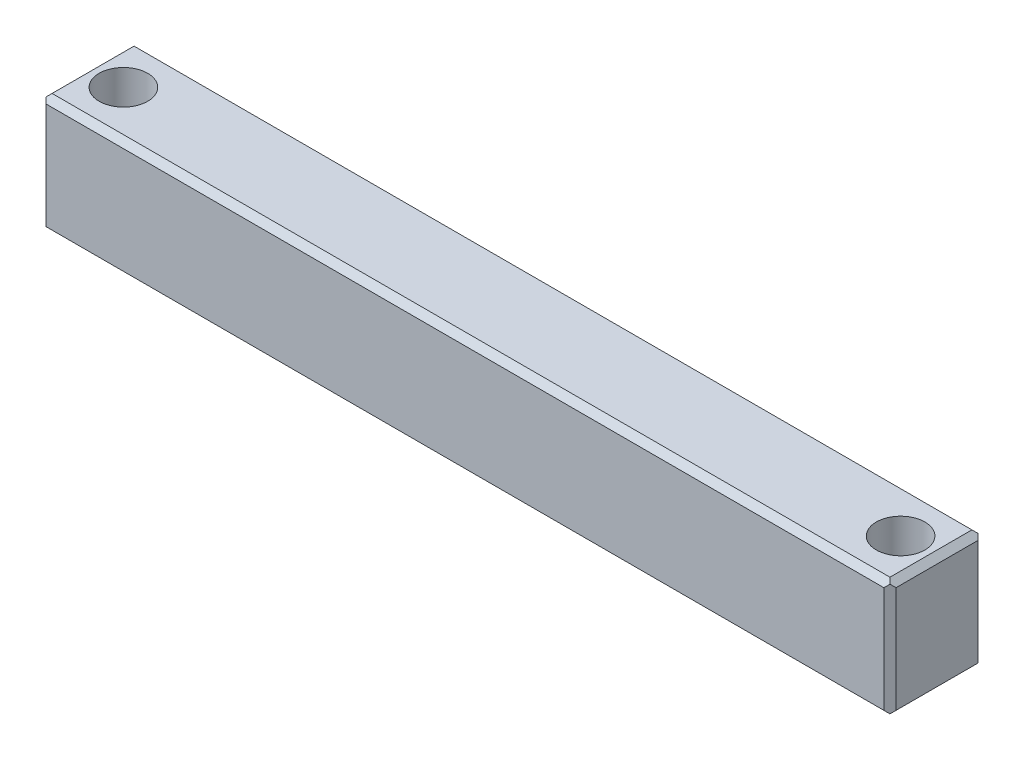
ISO-10303-21;
HEADER;
FILE_DESCRIPTION(('STEP AP214'),'2;1');
FILE_NAME('part.step','',(''),(''),'','','');
FILE_SCHEMA(('AUTOMOTIVE_DESIGN { 1 0 10303 214 1 1 1 1 }'));
ENDSEC;
DATA;
#1=APPLICATION_CONTEXT('core data for automotive mechanical design processes');
#2=APPLICATION_PROTOCOL_DEFINITION('international standard','automotive_design',2000,#1);
#3=PRODUCT_CONTEXT('',#1,'mechanical');
#4=PRODUCT('Part','Part','',(#3));
#5=PRODUCT_RELATED_PRODUCT_CATEGORY('part','',(#4));
#6=PRODUCT_DEFINITION_FORMATION('','',#4);
#7=PRODUCT_DEFINITION_CONTEXT('part definition',#1,'design');
#8=PRODUCT_DEFINITION('design','',#6,#7);
#9=PRODUCT_DEFINITION_SHAPE('','',#8);
#10=(LENGTH_UNIT() NAMED_UNIT(*) SI_UNIT(.MILLI.,.METRE.));
#11=(NAMED_UNIT(*) PLANE_ANGLE_UNIT() SI_UNIT($,.RADIAN.));
#12=(NAMED_UNIT(*) SI_UNIT($,.STERADIAN.) SOLID_ANGLE_UNIT());
#13=UNCERTAINTY_MEASURE_WITH_UNIT(LENGTH_MEASURE(1.E-05),#10,'distance_accuracy_value','');
#14=(GEOMETRIC_REPRESENTATION_CONTEXT(3) GLOBAL_UNCERTAINTY_ASSIGNED_CONTEXT((#13)) GLOBAL_UNIT_ASSIGNED_CONTEXT((#10,
#11,#12)) REPRESENTATION_CONTEXT('',''));
#15=CARTESIAN_POINT('',(0.,0.,0.));
#16=DIRECTION('',(0.,0.,1.));
#17=DIRECTION('',(1.,0.,0.));
#18=AXIS2_PLACEMENT_3D('',#15,#16,#17);
#19=CARTESIAN_POINT('',(70.,0.,0.));
#20=DIRECTION('',(0.,0.,-1.));
#21=DIRECTION('',(0.,1.,0.));
#22=AXIS2_PLACEMENT_3D('',#19,#20,#21);
#23=PLANE('',#22);
#24=DIRECTION('',(0.,1.,0.));
#25=VECTOR('',#24,1.);
#26=CARTESIAN_POINT('',(69.5,0.,0.));
#27=LINE('',#26,#25);
#28=CARTESIAN_POINT('',(69.5,0.499999999999987,0.));
#29=VERTEX_POINT('',#28);
#30=CARTESIAN_POINT('',(69.5,9.25000000000001,0.));
#31=VERTEX_POINT('',#30);
#32=EDGE_CURVE('E191',#29,#31,#27,.T.);
#33=ORIENTED_EDGE('',*,*,#32,.T.);
#34=DIRECTION('',(-1.,0.,0.));
#35=VECTOR('',#34,1.);
#36=CARTESIAN_POINT('',(70.,9.25000000000001,0.));
#37=LINE('',#36,#35);
#38=CARTESIAN_POINT('',(0.499999999999987,9.25000000000001,0.));
#39=VERTEX_POINT('',#38);
#40=EDGE_CURVE('E223',#31,#39,#37,.T.);
#41=ORIENTED_EDGE('',*,*,#40,.T.);
#42=DIRECTION('',(0.,-1.,0.));
#43=VECTOR('',#42,1.);
#44=CARTESIAN_POINT('',(0.499999999999987,0.,0.));
#45=LINE('',#44,#43);
#46=CARTESIAN_POINT('',(0.499999999999987,0.499999999999987,0.));
#47=VERTEX_POINT('',#46);
#48=EDGE_CURVE('E194',#39,#47,#45,.T.);
#49=ORIENTED_EDGE('',*,*,#48,.T.);
#50=DIRECTION('',(1.,0.,0.));
#51=VECTOR('',#50,1.);
#52=CARTESIAN_POINT('',(70.,0.499999999999987,0.));
#53=LINE('',#52,#51);
#54=EDGE_CURVE('E207',#47,#29,#53,.T.);
#55=ORIENTED_EDGE('',*,*,#54,.T.);
#56=EDGE_LOOP('',(#33,#41,#49,#55));
#57=FACE_BOUND('',#56,.T.);
#58=ADVANCED_FACE('F35',(#57),#23,.F.);
#59=CARTESIAN_POINT('',(70.,0.,0.));
#60=DIRECTION('',(0.,1.,0.));
#61=DIRECTION('',(0.,0.,1.));
#62=AXIS2_PLACEMENT_3D('',#59,#60,#61);
#63=PLANE('',#62);
#64=CARTESIAN_POINT('',(3.,0.,-3.875));
#65=DIRECTION('',(0.,1.,0.));
#66=DIRECTION('',(0.,0.,1.));
#67=AXIS2_PLACEMENT_3D('',#64,#65,#66);
#68=CIRCLE('',#67,2.);
#69=CARTESIAN_POINT('',(3.,0.,-1.87499999999999));
#70=VERTEX_POINT('',#69);
#71=EDGE_CURVE('E304',#70,#70,#68,.F.);
#72=ORIENTED_EDGE('',*,*,#71,.F.);
#73=EDGE_LOOP('',(#72));
#74=FACE_BOUND('',#73,.T.);
#75=CARTESIAN_POINT('',(67.,0.,-3.87499999999999));
#76=DIRECTION('',(0.,1.,0.));
#77=DIRECTION('',(0.,0.,1.));
#78=AXIS2_PLACEMENT_3D('',#75,#76,#77);
#79=CIRCLE('',#78,2.);
#80=CARTESIAN_POINT('',(67.,0.,-1.875));
#81=VERTEX_POINT('',#80);
#82=EDGE_CURVE('E312',#81,#81,#79,.F.);
#83=ORIENTED_EDGE('',*,*,#82,.F.);
#84=EDGE_LOOP('',(#83));
#85=FACE_BOUND('',#84,.T.);
#86=DIRECTION('',(0.,0.,1.));
#87=VECTOR('',#86,1.);
#88=CARTESIAN_POINT('',(69.5,0.,0.));
#89=LINE('',#88,#87);
#90=CARTESIAN_POINT('',(69.5,0.,-7.25000000000001));
#91=VERTEX_POINT('',#90);
#92=CARTESIAN_POINT('',(69.5,0.,-0.499999999999986));
#93=VERTEX_POINT('',#92);
#94=EDGE_CURVE('E300',#91,#93,#89,.T.);
#95=ORIENTED_EDGE('',*,*,#94,.T.);
#96=DIRECTION('',(-1.,0.,0.));
#97=VECTOR('',#96,1.);
#98=CARTESIAN_POINT('',(70.,0.,-0.499999999999986));
#99=LINE('',#98,#97);
#100=CARTESIAN_POINT('',(0.499999999999987,0.,-0.499999999999987));
#101=VERTEX_POINT('',#100);
#102=EDGE_CURVE('E249',#93,#101,#99,.T.);
#103=ORIENTED_EDGE('',*,*,#102,.T.);
#104=DIRECTION('',(0.,0.,-1.));
#105=VECTOR('',#104,1.);
#106=CARTESIAN_POINT('',(0.499999999999987,0.,-7.75000000000001));
#107=LINE('',#106,#105);
#108=CARTESIAN_POINT('',(0.499999999999987,0.,-7.25000000000001));
#109=VERTEX_POINT('',#108);
#110=EDGE_CURVE('E172',#101,#109,#107,.T.);
#111=ORIENTED_EDGE('',*,*,#110,.T.);
#112=DIRECTION('',(1.,0.,0.));
#113=VECTOR('',#112,1.);
#114=CARTESIAN_POINT('',(70.,0.,-7.25000000000001));
#115=LINE('',#114,#113);
#116=EDGE_CURVE('E247',#109,#91,#115,.T.);
#117=ORIENTED_EDGE('',*,*,#116,.T.);
#118=EDGE_LOOP('',(#95,#103,#111,#117));
#119=FACE_BOUND('',#118,.T.);
#120=ADVANCED_FACE('F317',(#74,#85,#119),#63,.F.);
#121=CARTESIAN_POINT('',(70.,0.,-7.75000000000001));
#122=DIRECTION('',(0.,0.,1.));
#123=DIRECTION('',(0.,-1.,0.));
#124=AXIS2_PLACEMENT_3D('',#121,#122,#123);
#125=PLANE('',#124);
#126=DIRECTION('',(0.,1.,0.));
#127=VECTOR('',#126,1.);
#128=CARTESIAN_POINT('',(0.499999999999987,9.75,-7.75));
#129=LINE('',#128,#127);
#130=CARTESIAN_POINT('',(0.499999999999987,0.499999999999987,-7.75000000000001));
#131=VERTEX_POINT('',#130);
#132=CARTESIAN_POINT('',(0.499999999999987,9.25,-7.75));
#133=VERTEX_POINT('',#132);
#134=EDGE_CURVE('E179',#131,#133,#129,.T.);
#135=ORIENTED_EDGE('',*,*,#134,.T.);
#136=DIRECTION('',(1.,0.,0.));
#137=VECTOR('',#136,1.);
#138=CARTESIAN_POINT('',(70.,9.25,-7.75));
#139=LINE('',#138,#137);
#140=CARTESIAN_POINT('',(69.5,9.25,-7.75));
#141=VERTEX_POINT('',#140);
#142=EDGE_CURVE('E57',#133,#141,#139,.T.);
#143=ORIENTED_EDGE('',*,*,#142,.T.);
#144=DIRECTION('',(0.,-1.,0.));
#145=VECTOR('',#144,1.);
#146=CARTESIAN_POINT('',(69.5,0.,-7.75000000000001));
#147=LINE('',#146,#145);
#148=CARTESIAN_POINT('',(69.5,0.499999999999986,-7.75000000000001));
#149=VERTEX_POINT('',#148);
#150=EDGE_CURVE('E177',#141,#149,#147,.T.);
#151=ORIENTED_EDGE('',*,*,#150,.T.);
#152=DIRECTION('',(-1.,0.,0.));
#153=VECTOR('',#152,1.);
#154=CARTESIAN_POINT('',(70.,0.499999999999986,-7.75000000000001));
#155=LINE('',#154,#153);
#156=EDGE_CURVE('E263',#149,#131,#155,.T.);
#157=ORIENTED_EDGE('',*,*,#156,.T.);
#158=EDGE_LOOP('',(#135,#143,#151,#157));
#159=FACE_BOUND('',#158,.T.);
#160=ADVANCED_FACE('F268',(#159),#125,.F.);
#161=CARTESIAN_POINT('',(70.,9.75,0.));
#162=DIRECTION('',(0.,-1.,0.));
#163=DIRECTION('',(0.,0.,-1.));
#164=AXIS2_PLACEMENT_3D('',#161,#162,#163);
#165=PLANE('',#164);
#166=CARTESIAN_POINT('',(3.,9.75,-3.875));
#167=DIRECTION('',(0.,1.,0.));
#168=DIRECTION('',(0.,0.,1.));
#169=AXIS2_PLACEMENT_3D('',#166,#167,#168);
#170=CIRCLE('',#169,2.);
#171=CARTESIAN_POINT('',(3.,9.75,-1.87499999999999));
#172=VERTEX_POINT('',#171);
#173=EDGE_CURVE('E309',#172,#172,#170,.T.);
#174=ORIENTED_EDGE('',*,*,#173,.F.);
#175=EDGE_LOOP('',(#174));
#176=FACE_BOUND('',#175,.T.);
#177=CARTESIAN_POINT('',(67.,9.75,-3.87499999999999));
#178=DIRECTION('',(0.,1.,0.));
#179=DIRECTION('',(0.,0.,1.));
#180=AXIS2_PLACEMENT_3D('',#177,#178,#179);
#181=CIRCLE('',#180,2.);
#182=CARTESIAN_POINT('',(67.,9.75,-1.875));
#183=VERTEX_POINT('',#182);
#184=EDGE_CURVE('E213',#183,#183,#181,.T.);
#185=ORIENTED_EDGE('',*,*,#184,.F.);
#186=EDGE_LOOP('',(#185));
#187=FACE_BOUND('',#186,.T.);
#188=DIRECTION('',(0.,0.,1.));
#189=VECTOR('',#188,1.);
#190=CARTESIAN_POINT('',(0.499999999999987,9.75,0.));
#191=LINE('',#190,#189);
#192=CARTESIAN_POINT('',(0.499999999999987,9.75,-7.25));
#193=VERTEX_POINT('',#192);
#194=CARTESIAN_POINT('',(0.499999999999987,9.75,-0.499999999999987));
#195=VERTEX_POINT('',#194);
#196=EDGE_CURVE('E188',#193,#195,#191,.T.);
#197=ORIENTED_EDGE('',*,*,#196,.T.);
#198=DIRECTION('',(1.,0.,0.));
#199=VECTOR('',#198,1.);
#200=CARTESIAN_POINT('',(70.,9.75,-0.499999999999987));
#201=LINE('',#200,#199);
#202=CARTESIAN_POINT('',(69.5,9.75,-0.499999999999987));
#203=VERTEX_POINT('',#202);
#204=EDGE_CURVE('E237',#195,#203,#201,.T.);
#205=ORIENTED_EDGE('',*,*,#204,.T.);
#206=DIRECTION('',(0.,0.,-1.));
#207=VECTOR('',#206,1.);
#208=CARTESIAN_POINT('',(69.5,9.75,0.));
#209=LINE('',#208,#207);
#210=CARTESIAN_POINT('',(69.5,9.75,-7.25));
#211=VERTEX_POINT('',#210);
#212=EDGE_CURVE('E185',#203,#211,#209,.T.);
#213=ORIENTED_EDGE('',*,*,#212,.T.);
#214=DIRECTION('',(-1.,0.,0.));
#215=VECTOR('',#214,1.);
#216=CARTESIAN_POINT('',(70.,9.75,-7.25));
#217=LINE('',#216,#215);
#218=EDGE_CURVE('E234',#211,#193,#217,.T.);
#219=ORIENTED_EDGE('',*,*,#218,.T.);
#220=EDGE_LOOP('',(#197,#205,#213,#219));
#221=FACE_BOUND('',#220,.T.);
#222=ADVANCED_FACE('F332',(#176,#187,#221),#165,.F.);
#223=CARTESIAN_POINT('',(70.,0.,0.));
#224=DIRECTION('',(-1.,0.,0.));
#225=DIRECTION('',(0.,0.,1.));
#226=AXIS2_PLACEMENT_3D('',#223,#224,#225);
#227=PLANE('',#226);
#228=DIRECTION('',(0.,1.,0.));
#229=VECTOR('',#228,1.);
#230=CARTESIAN_POINT('',(70.,0.,-7.25));
#231=LINE('',#230,#229);
#232=CARTESIAN_POINT('',(70.,0.5,-7.25));
#233=VERTEX_POINT('',#232);
#234=CARTESIAN_POINT('',(70.,9.25,-7.25));
#235=VERTEX_POINT('',#234);
#236=EDGE_CURVE('E202',#233,#235,#231,.T.);
#237=ORIENTED_EDGE('',*,*,#236,.T.);
#238=DIRECTION('',(0.,0.,1.));
#239=VECTOR('',#238,1.);
#240=CARTESIAN_POINT('',(70.,9.25,0.));
#241=LINE('',#240,#239);
#242=CARTESIAN_POINT('',(70.,9.25,-0.499999999999994));
#243=VERTEX_POINT('',#242);
#244=EDGE_CURVE('E204',#235,#243,#241,.T.);
#245=ORIENTED_EDGE('',*,*,#244,.T.);
#246=DIRECTION('',(0.,-1.,0.));
#247=VECTOR('',#246,1.);
#248=CARTESIAN_POINT('',(70.,0.,-0.5));
#249=LINE('',#248,#247);
#250=CARTESIAN_POINT('',(70.,0.5,-0.5));
#251=VERTEX_POINT('',#250);
#252=EDGE_CURVE('E197',#243,#251,#249,.T.);
#253=ORIENTED_EDGE('',*,*,#252,.T.);
#254=DIRECTION('',(0.,0.,-1.));
#255=VECTOR('',#254,1.);
#256=CARTESIAN_POINT('',(70.,0.5,0.));
#257=LINE('',#256,#255);
#258=EDGE_CURVE('E200',#251,#233,#257,.T.);
#259=ORIENTED_EDGE('',*,*,#258,.T.);
#260=EDGE_LOOP('',(#237,#245,#253,#259));
#261=FACE_BOUND('',#260,.T.);
#262=ADVANCED_FACE('F289',(#261),#227,.F.);
#263=CARTESIAN_POINT('',(0.,0.,0.));
#264=DIRECTION('',(-1.,0.,0.));
#265=DIRECTION('',(0.,0.,1.));
#266=AXIS2_PLACEMENT_3D('',#263,#264,#265);
#267=PLANE('',#266);
#268=DIRECTION('',(0.,-1.,0.));
#269=VECTOR('',#268,1.);
#270=CARTESIAN_POINT('',(0.,0.,-7.25000000000001));
#271=LINE('',#270,#269);
#272=CARTESIAN_POINT('',(0.,9.25000000000001,-7.25));
#273=VERTEX_POINT('',#272);
#274=CARTESIAN_POINT('',(0.,0.499999999999994,-7.25000000000001));
#275=VERTEX_POINT('',#274);
#276=EDGE_CURVE('E176',#273,#275,#271,.T.);
#277=ORIENTED_EDGE('',*,*,#276,.T.);
#278=DIRECTION('',(0.,0.,1.));
#279=VECTOR('',#278,1.);
#280=CARTESIAN_POINT('',(0.,0.499999999999994,0.));
#281=LINE('',#280,#279);
#282=CARTESIAN_POINT('',(0.,0.499999999999994,-0.499999999999993));
#283=VERTEX_POINT('',#282);
#284=EDGE_CURVE('E155',#275,#283,#281,.T.);
#285=ORIENTED_EDGE('',*,*,#284,.T.);
#286=DIRECTION('',(0.,1.,0.));
#287=VECTOR('',#286,1.);
#288=CARTESIAN_POINT('',(0.,9.75,-0.499999999999986));
#289=LINE('',#288,#287);
#290=CARTESIAN_POINT('',(0.,9.25000000000001,-0.499999999999987));
#291=VERTEX_POINT('',#290);
#292=EDGE_CURVE('E164',#283,#291,#289,.T.);
#293=ORIENTED_EDGE('',*,*,#292,.T.);
#294=DIRECTION('',(0.,0.,-1.));
#295=VECTOR('',#294,1.);
#296=CARTESIAN_POINT('',(0.,9.25000000000001,-7.75));
#297=LINE('',#296,#295);
#298=EDGE_CURVE('E171',#291,#273,#297,.T.);
#299=ORIENTED_EDGE('',*,*,#298,.T.);
#300=EDGE_LOOP('',(#277,#285,#293,#299));
#301=FACE_BOUND('',#300,.T.);
#302=ADVANCED_FACE('F174',(#301),#267,.T.);
#303=CARTESIAN_POINT('',(67.,-5.65685424949238,-3.87499999999999));
#304=DIRECTION('',(0.,1.,0.));
#305=DIRECTION('',(0.,0.,1.));
#306=AXIS2_PLACEMENT_3D('',#303,#304,#305);
#307=CYLINDRICAL_SURFACE('',#306,2.);
#308=ORIENTED_EDGE('',*,*,#82,.T.);
#309=EDGE_LOOP('',(#308));
#310=FACE_BOUND('',#309,.T.);
#311=ORIENTED_EDGE('',*,*,#184,.T.);
#312=EDGE_LOOP('',(#311));
#313=FACE_BOUND('',#312,.T.);
#314=ADVANCED_FACE('F488',(#310,#313),#307,.F.);
#315=CARTESIAN_POINT('',(3.,-5.65685424949238,-3.875));
#316=DIRECTION('',(0.,1.,0.));
#317=DIRECTION('',(0.,0.,1.));
#318=AXIS2_PLACEMENT_3D('',#315,#316,#317);
#319=CYLINDRICAL_SURFACE('',#318,2.);
#320=ORIENTED_EDGE('',*,*,#71,.T.);
#321=EDGE_LOOP('',(#320));
#322=FACE_BOUND('',#321,.T.);
#323=ORIENTED_EDGE('',*,*,#173,.T.);
#324=EDGE_LOOP('',(#323));
#325=FACE_BOUND('',#324,.T.);
#326=ADVANCED_FACE('F373',(#322,#325),#319,.F.);
#327=CARTESIAN_POINT('',(0.499999999999987,9.75,0.));
#328=DIRECTION('',(-0.707106781186552,0.707106781186543,0.));
#329=DIRECTION('',(0.,0.,-1.));
#330=AXIS2_PLACEMENT_3D('',#327,#328,#329);
#331=PLANE('',#330);
#332=DIRECTION('',(-0.57735026918962,-0.577350269189628,-0.577350269189629));
#333=VECTOR('',#332,1.);
#334=CARTESIAN_POINT('',(-2.75,6.49999999999997,-3.25000000000003));
#335=LINE('',#334,#333);
#336=CARTESIAN_POINT('',(0.249999999999994,9.50000000000001,-0.249999999999989));
#337=VERTEX_POINT('',#336);
#338=EDGE_CURVE('E168',#337,#291,#335,.T.);
#339=ORIENTED_EDGE('',*,*,#338,.F.);
#340=DIRECTION('',(-0.577350269189618,-0.577350269189626,0.577350269189634));
#341=VECTOR('',#340,1.);
#342=CARTESIAN_POINT('',(0.333333333333322,9.58333333333333,-0.333333333333318));
#343=LINE('',#342,#341);
#344=EDGE_CURVE('E232',#337,#195,#343,.F.);
#345=ORIENTED_EDGE('',*,*,#344,.T.);
#346=ORIENTED_EDGE('',*,*,#196,.F.);
#347=DIRECTION('',(0.577350269189621,0.577350269189629,0.577350269189629));
#348=VECTOR('',#347,1.);
#349=CARTESIAN_POINT('',(2.91666666666664,12.1666666666667,-4.83333333333331));
#350=LINE('',#349,#348);
#351=CARTESIAN_POINT('',(0.24999999999999,9.5,-7.5));
#352=VERTEX_POINT('',#351);
#353=EDGE_CURVE('E230',#193,#352,#350,.F.);
#354=ORIENTED_EDGE('',*,*,#353,.T.);
#355=DIRECTION('',(-0.577350269189621,-0.577350269189629,0.577350269189628));
#356=VECTOR('',#355,1.);
#357=CARTESIAN_POINT('',(-2.08333333333334,7.16666666666664,-5.16666666666664));
#358=LINE('',#357,#356);
#359=EDGE_CURVE('E160',#273,#352,#358,.F.);
#360=ORIENTED_EDGE('',*,*,#359,.F.);
#361=ORIENTED_EDGE('',*,*,#298,.F.);
#362=EDGE_LOOP('',(#339,#345,#346,#354,#360,#361));
#363=FACE_BOUND('',#362,.T.);
#364=ADVANCED_FACE('F315',(#363),#331,.T.);
#365=CARTESIAN_POINT('',(0.499999999999987,0.,0.));
#366=DIRECTION('',(-0.707106781186552,0.,0.707106781186543));
#367=DIRECTION('',(0.,1.,0.));
#368=AXIS2_PLACEMENT_3D('',#365,#366,#367);
#369=PLANE('',#368);
#370=ORIENTED_EDGE('',*,*,#48,.F.);
#371=DIRECTION('',(0.577350269189623,-0.577350269189623,0.577350269189631));
#372=VECTOR('',#371,1.);
#373=CARTESIAN_POINT('',(3.58333333333329,6.16666666666671,3.08333333333335));
#374=LINE('',#373,#372);
#375=EDGE_CURVE('E228',#39,#337,#374,.F.);
#376=ORIENTED_EDGE('',*,*,#375,.T.);
#377=ORIENTED_EDGE('',*,*,#338,.T.);
#378=ORIENTED_EDGE('',*,*,#292,.F.);
#379=DIRECTION('',(0.577350269189621,-0.577350269189629,0.577350269189628));
#380=VECTOR('',#379,1.);
#381=CARTESIAN_POINT('',(0.499999999999987,0.,0.));
#382=LINE('',#381,#380);
#383=CARTESIAN_POINT('',(0.249999999999997,0.249999999999993,-0.249999999999993));
#384=VERTEX_POINT('',#383);
#385=EDGE_CURVE('E149',#384,#283,#382,.F.);
#386=ORIENTED_EDGE('',*,*,#385,.F.);
#387=DIRECTION('',(-0.57735026918962,-0.577350269189629,-0.577350269189629));
#388=VECTOR('',#387,1.);
#389=CARTESIAN_POINT('',(0.333333333333325,0.333333333333323,-0.166666666666664));
#390=LINE('',#389,#388);
#391=EDGE_CURVE('E226',#384,#47,#390,.F.);
#392=ORIENTED_EDGE('',*,*,#391,.T.);
#393=EDGE_LOOP('',(#370,#376,#377,#378,#386,#392));
#394=FACE_BOUND('',#393,.T.);
#395=ADVANCED_FACE('F166',(#394),#369,.T.);
#396=CARTESIAN_POINT('',(0.499999999999987,0.,-7.75000000000001));
#397=DIRECTION('',(-0.707106781186552,0.,-0.707106781186543));
#398=DIRECTION('',(0.,-1.,0.));
#399=AXIS2_PLACEMENT_3D('',#396,#397,#398);
#400=PLANE('',#399);
#401=ORIENTED_EDGE('',*,*,#359,.T.);
#402=DIRECTION('',(-0.57735026918962,0.577350269189629,0.577350269189629));
#403=VECTOR('',#402,1.);
#404=CARTESIAN_POINT('',(3.58333333333331,6.16666666666663,-10.8333333333334));
#405=LINE('',#404,#403);
#406=EDGE_CURVE('E261',#352,#133,#405,.F.);
#407=ORIENTED_EDGE('',*,*,#406,.T.);
#408=ORIENTED_EDGE('',*,*,#134,.F.);
#409=DIRECTION('',(0.577350269189623,0.577350269189623,-0.577350269189631));
#410=VECTOR('',#409,1.);
#411=CARTESIAN_POINT('',(0.333333333333326,0.333333333333326,-7.58333333333334));
#412=LINE('',#411,#410);
#413=CARTESIAN_POINT('',(0.249999999999995,0.249999999999995,-7.50000000000001));
#414=VERTEX_POINT('',#413);
#415=EDGE_CURVE('E259',#131,#414,#412,.F.);
#416=ORIENTED_EDGE('',*,*,#415,.T.);
#417=DIRECTION('',(-0.57735026918962,0.577350269189628,0.577350269189629));
#418=VECTOR('',#417,1.);
#419=CARTESIAN_POINT('',(0.499999999999987,0.,-7.75000000000001));
#420=LINE('',#419,#418);
#421=EDGE_CURVE('E161',#275,#414,#420,.F.);
#422=ORIENTED_EDGE('',*,*,#421,.F.);
#423=ORIENTED_EDGE('',*,*,#276,.F.);
#424=EDGE_LOOP('',(#401,#407,#408,#416,#422,#423));
#425=FACE_BOUND('',#424,.T.);
#426=ADVANCED_FACE('F271',(#425),#400,.T.);
#427=CARTESIAN_POINT('',(0.499999999999987,0.,0.));
#428=DIRECTION('',(-0.707106781186552,-0.707106781186543,0.));
#429=DIRECTION('',(0.,0.,1.));
#430=AXIS2_PLACEMENT_3D('',#427,#428,#429);
#431=PLANE('',#430);
#432=ORIENTED_EDGE('',*,*,#110,.F.);
#433=DIRECTION('',(0.57735026918962,-0.577350269189628,-0.577350269189628));
#434=VECTOR('',#433,1.);
#435=CARTESIAN_POINT('',(0.333333333333325,0.166666666666664,-0.333333333333323));
#436=LINE('',#435,#434);
#437=EDGE_CURVE('E157',#101,#384,#436,.F.);
#438=ORIENTED_EDGE('',*,*,#437,.T.);
#439=ORIENTED_EDGE('',*,*,#385,.T.);
#440=ORIENTED_EDGE('',*,*,#284,.F.);
#441=ORIENTED_EDGE('',*,*,#421,.T.);
#442=DIRECTION('',(-0.577350269189618,0.577350269189626,-0.577350269189634));
#443=VECTOR('',#442,1.);
#444=CARTESIAN_POINT('',(2.91666666666666,-2.4166666666667,-4.83333333333327));
#445=LINE('',#444,#443);
#446=EDGE_CURVE('E252',#414,#109,#445,.F.);
#447=ORIENTED_EDGE('',*,*,#446,.T.);
#448=EDGE_LOOP('',(#432,#438,#439,#440,#441,#447));
#449=FACE_BOUND('',#448,.T.);
#450=ADVANCED_FACE('F152',(#449),#431,.T.);
#451=CARTESIAN_POINT('',(70.,0.5,0.));
#452=DIRECTION('',(-0.707106781186547,0.707106781186547,0.));
#453=DIRECTION('',(0.,0.,-1.));
#454=AXIS2_PLACEMENT_3D('',#451,#452,#453);
#455=PLANE('',#454);
#456=DIRECTION('',(0.577350269189626,0.577350269189626,-0.577350269189626));
#457=VECTOR('',#456,1.);
#458=CARTESIAN_POINT('',(69.8333333333333,0.333333333333334,-0.333333333333334));
#459=LINE('',#458,#457);
#460=CARTESIAN_POINT('',(69.75,0.249999999999994,-0.249999999999994));
#461=VERTEX_POINT('',#460);
#462=EDGE_CURVE('E219',#461,#251,#459,.T.);
#463=ORIENTED_EDGE('',*,*,#462,.F.);
#464=DIRECTION('',(-0.577350269189626,-0.577350269189626,-0.577350269189626));
#465=VECTOR('',#464,1.);
#466=CARTESIAN_POINT('',(70.,0.5,0.));
#467=LINE('',#466,#465);
#468=EDGE_CURVE('E257',#461,#93,#467,.T.);
#469=ORIENTED_EDGE('',*,*,#468,.T.);
#470=ORIENTED_EDGE('',*,*,#94,.F.);
#471=DIRECTION('',(0.577350269189623,0.577350269189623,-0.577350269189631));
#472=VECTOR('',#471,1.);
#473=CARTESIAN_POINT('',(67.4166666666667,-2.08333333333335,-5.16666666666663));
#474=LINE('',#473,#472);
#475=CARTESIAN_POINT('',(69.75,0.249999999999993,-7.50000000000001));
#476=VERTEX_POINT('',#475);
#477=EDGE_CURVE('E255',#91,#476,#474,.T.);
#478=ORIENTED_EDGE('',*,*,#477,.T.);
#479=DIRECTION('',(0.577350269189626,0.577350269189626,0.577350269189626));
#480=VECTOR('',#479,1.);
#481=CARTESIAN_POINT('',(72.4166666666667,2.91666666666667,-4.83333333333333));
#482=LINE('',#481,#480);
#483=EDGE_CURVE('E208',#233,#476,#482,.F.);
#484=ORIENTED_EDGE('',*,*,#483,.F.);
#485=ORIENTED_EDGE('',*,*,#258,.F.);
#486=EDGE_LOOP('',(#463,#469,#470,#478,#484,#485));
#487=FACE_BOUND('',#486,.T.);
#488=ADVANCED_FACE('F298',(#487),#455,.F.);
#489=CARTESIAN_POINT('',(70.,0.,-7.25));
#490=DIRECTION('',(-0.707106781186547,0.,0.707106781186547));
#491=DIRECTION('',(0.,1.,0.));
#492=AXIS2_PLACEMENT_3D('',#489,#490,#491);
#493=PLANE('',#492);
#494=ORIENTED_EDGE('',*,*,#150,.F.);
#495=DIRECTION('',(0.577350269189626,0.577350269189626,0.577350269189626));
#496=VECTOR('',#495,1.);
#497=CARTESIAN_POINT('',(66.75,6.5,-10.5));
#498=LINE('',#497,#496);
#499=CARTESIAN_POINT('',(69.75,9.5,-7.5));
#500=VERTEX_POINT('',#499);
#501=EDGE_CURVE('E11',#141,#500,#498,.T.);
#502=ORIENTED_EDGE('',*,*,#501,.T.);
#503=DIRECTION('',(0.577350269189626,-0.577350269189626,0.577350269189626));
#504=VECTOR('',#503,1.);
#505=CARTESIAN_POINT('',(73.0833333333333,6.16666666666667,-4.16666666666667));
#506=LINE('',#505,#504);
#507=EDGE_CURVE('E216',#235,#500,#506,.F.);
#508=ORIENTED_EDGE('',*,*,#507,.F.);
#509=ORIENTED_EDGE('',*,*,#236,.F.);
#510=ORIENTED_EDGE('',*,*,#483,.T.);
#511=DIRECTION('',(-0.577350269189629,0.57735026918962,-0.577350269189628));
#512=VECTOR('',#511,1.);
#513=CARTESIAN_POINT('',(70.,0.,-7.25));
#514=LINE('',#513,#512);
#515=EDGE_CURVE('E44',#476,#149,#514,.T.);
#516=ORIENTED_EDGE('',*,*,#515,.T.);
#517=EDGE_LOOP('',(#494,#502,#508,#509,#510,#516));
#518=FACE_BOUND('',#517,.T.);
#519=ADVANCED_FACE('F280',(#518),#493,.F.);
#520=CARTESIAN_POINT('',(70.,0.,-0.5));
#521=DIRECTION('',(-0.707106781186547,0.,-0.707106781186547));
#522=DIRECTION('',(0.,-1.,0.));
#523=AXIS2_PLACEMENT_3D('',#520,#521,#522);
#524=PLANE('',#523);
#525=DIRECTION('',(-0.577350269189626,0.577350269189626,0.577350269189626));
#526=VECTOR('',#525,1.);
#527=CARTESIAN_POINT('',(73.0833333333333,6.16666666666667,-3.58333333333333));
#528=LINE('',#527,#526);
#529=CARTESIAN_POINT('',(69.75,9.50000000000001,-0.249999999999987));
#530=VERTEX_POINT('',#529);
#531=EDGE_CURVE('E214',#530,#243,#528,.F.);
#532=ORIENTED_EDGE('',*,*,#531,.F.);
#533=DIRECTION('',(-0.577350269189629,-0.57735026918962,0.577350269189628));
#534=VECTOR('',#533,1.);
#535=CARTESIAN_POINT('',(66.75,6.50000000000007,2.74999999999999));
#536=LINE('',#535,#534);
#537=EDGE_CURVE('E245',#530,#31,#536,.T.);
#538=ORIENTED_EDGE('',*,*,#537,.T.);
#539=ORIENTED_EDGE('',*,*,#32,.F.);
#540=DIRECTION('',(0.577350269189626,-0.577350269189626,-0.577350269189626));
#541=VECTOR('',#540,1.);
#542=CARTESIAN_POINT('',(70.,0.,-0.5));
#543=LINE('',#542,#541);
#544=EDGE_CURVE('E243',#29,#461,#543,.T.);
#545=ORIENTED_EDGE('',*,*,#544,.T.);
#546=ORIENTED_EDGE('',*,*,#462,.T.);
#547=ORIENTED_EDGE('',*,*,#252,.F.);
#548=EDGE_LOOP('',(#532,#538,#539,#545,#546,#547));
#549=FACE_BOUND('',#548,.T.);
#550=ADVANCED_FACE('F334',(#549),#524,.F.);
#551=CARTESIAN_POINT('',(70.,9.25,0.));
#552=DIRECTION('',(-0.707106781186547,-0.707106781186547,0.));
#553=DIRECTION('',(0.,0.,1.));
#554=AXIS2_PLACEMENT_3D('',#551,#552,#553);
#555=PLANE('',#554);
#556=ORIENTED_EDGE('',*,*,#212,.F.);
#557=DIRECTION('',(0.577350269189623,-0.577350269189623,0.577350269189631));
#558=VECTOR('',#557,1.);
#559=CARTESIAN_POINT('',(70.,9.25,0.));
#560=LINE('',#559,#558);
#561=EDGE_CURVE('E241',#203,#530,#560,.T.);
#562=ORIENTED_EDGE('',*,*,#561,.T.);
#563=ORIENTED_EDGE('',*,*,#531,.T.);
#564=ORIENTED_EDGE('',*,*,#244,.F.);
#565=ORIENTED_EDGE('',*,*,#507,.T.);
#566=DIRECTION('',(-0.577350269189626,0.577350269189626,0.577350269189626));
#567=VECTOR('',#566,1.);
#568=CARTESIAN_POINT('',(67.4166666666667,11.8333333333333,-5.16666666666667));
#569=LINE('',#568,#567);
#570=EDGE_CURVE('E239',#500,#211,#569,.T.);
#571=ORIENTED_EDGE('',*,*,#570,.T.);
#572=EDGE_LOOP('',(#556,#562,#563,#564,#565,#571));
#573=FACE_BOUND('',#572,.T.);
#574=ADVANCED_FACE('F285',(#573),#555,.F.);
#575=CARTESIAN_POINT('',(70.,9.25000000000001,0.));
#576=DIRECTION('',(0.,-0.707106781186552,-0.707106781186543));
#577=DIRECTION('',(-1.,0.,0.));
#578=AXIS2_PLACEMENT_3D('',#575,#576,#577);
#579=PLANE('',#578);
#580=ORIENTED_EDGE('',*,*,#561,.F.);
#581=ORIENTED_EDGE('',*,*,#204,.F.);
#582=ORIENTED_EDGE('',*,*,#344,.F.);
#583=ORIENTED_EDGE('',*,*,#375,.F.);
#584=ORIENTED_EDGE('',*,*,#40,.F.);
#585=ORIENTED_EDGE('',*,*,#537,.F.);
#586=EDGE_LOOP('',(#580,#581,#582,#583,#584,#585));
#587=FACE_BOUND('',#586,.T.);
#588=ADVANCED_FACE('F328',(#587),#579,.F.);
#589=CARTESIAN_POINT('',(70.,0.,-0.499999999999986));
#590=DIRECTION('',(0.,0.707106781186548,-0.707106781186548));
#591=DIRECTION('',(-1.,0.,0.));
#592=AXIS2_PLACEMENT_3D('',#589,#590,#591);
#593=PLANE('',#592);
#594=ORIENTED_EDGE('',*,*,#544,.F.);
#595=ORIENTED_EDGE('',*,*,#54,.F.);
#596=ORIENTED_EDGE('',*,*,#391,.F.);
#597=ORIENTED_EDGE('',*,*,#437,.F.);
#598=ORIENTED_EDGE('',*,*,#102,.F.);
#599=ORIENTED_EDGE('',*,*,#468,.F.);
#600=EDGE_LOOP('',(#594,#595,#596,#597,#598,#599));
#601=FACE_BOUND('',#600,.T.);
#602=ADVANCED_FACE('F320',(#601),#593,.F.);
#603=CARTESIAN_POINT('',(70.,9.75,-7.25));
#604=DIRECTION('',(0.,-0.707106781186547,0.707106781186547));
#605=DIRECTION('',(-1.,0.,0.));
#606=AXIS2_PLACEMENT_3D('',#603,#604,#605);
#607=PLANE('',#606);
#608=ORIENTED_EDGE('',*,*,#501,.F.);
#609=ORIENTED_EDGE('',*,*,#142,.F.);
#610=ORIENTED_EDGE('',*,*,#406,.F.);
#611=ORIENTED_EDGE('',*,*,#353,.F.);
#612=ORIENTED_EDGE('',*,*,#218,.F.);
#613=ORIENTED_EDGE('',*,*,#570,.F.);
#614=EDGE_LOOP('',(#608,#609,#610,#611,#612,#613));
#615=FACE_BOUND('',#614,.T.);
#616=ADVANCED_FACE('F276',(#615),#607,.F.);
#617=CARTESIAN_POINT('',(70.,0.499999999999987,-7.75000000000001));
#618=DIRECTION('',(0.,0.707106781186552,0.707106781186543));
#619=DIRECTION('',(-1.,0.,0.));
#620=AXIS2_PLACEMENT_3D('',#617,#618,#619);
#621=PLANE('',#620);
#622=ORIENTED_EDGE('',*,*,#477,.F.);
#623=ORIENTED_EDGE('',*,*,#116,.F.);
#624=ORIENTED_EDGE('',*,*,#446,.F.);
#625=ORIENTED_EDGE('',*,*,#415,.F.);
#626=ORIENTED_EDGE('',*,*,#156,.F.);
#627=ORIENTED_EDGE('',*,*,#515,.F.);
#628=EDGE_LOOP('',(#622,#623,#624,#625,#626,#627));
#629=FACE_BOUND('',#628,.T.);
#630=ADVANCED_FACE('F38',(#629),#621,.F.);
#631=CLOSED_SHELL('',(#58,#120,#160,#222,#262,#302,#314,#326,#364,#395,#426,#450,#488,#519,#550,
#574,#588,#602,#616,#630));
#632=MANIFOLD_SOLID_BREP('B2',#631);
#633=ADVANCED_BREP_SHAPE_REPRESENTATION('',(#18,#632),#14);
#634=SHAPE_DEFINITION_REPRESENTATION(#9,#633);
ENDSEC;
END-ISO-10303-21;
